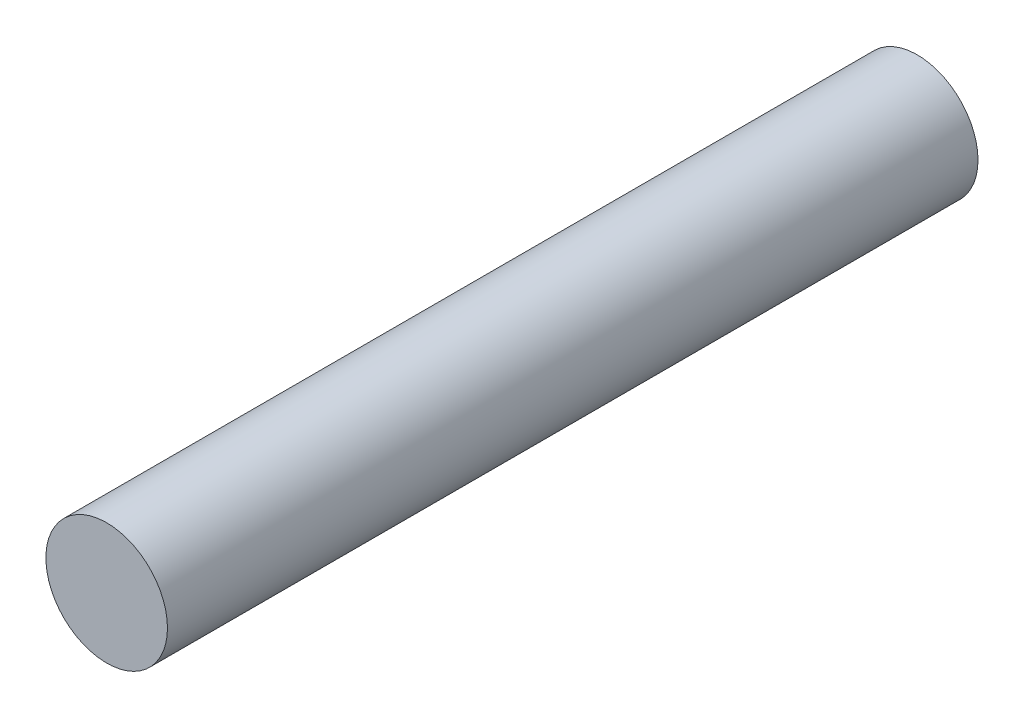
ISO-10303-21;
HEADER;
FILE_DESCRIPTION(('STEP AP214'),'2;1');
FILE_NAME('part.step','',(''),(''),'','','');
FILE_SCHEMA(('AUTOMOTIVE_DESIGN { 1 0 10303 214 1 1 1 1 }'));
ENDSEC;
DATA;
#1=APPLICATION_CONTEXT('core data for automotive mechanical design processes');
#2=APPLICATION_PROTOCOL_DEFINITION('international standard','automotive_design',2000,#1);
#3=PRODUCT_CONTEXT('',#1,'mechanical');
#4=PRODUCT('Part','Part','',(#3));
#5=PRODUCT_RELATED_PRODUCT_CATEGORY('part','',(#4));
#6=PRODUCT_DEFINITION_FORMATION('','',#4);
#7=PRODUCT_DEFINITION_CONTEXT('part definition',#1,'design');
#8=PRODUCT_DEFINITION('design','',#6,#7);
#9=PRODUCT_DEFINITION_SHAPE('','',#8);
#10=(LENGTH_UNIT() NAMED_UNIT(*) SI_UNIT(.MILLI.,.METRE.));
#11=(NAMED_UNIT(*) PLANE_ANGLE_UNIT() SI_UNIT($,.RADIAN.));
#12=(NAMED_UNIT(*) SI_UNIT($,.STERADIAN.) SOLID_ANGLE_UNIT());
#13=UNCERTAINTY_MEASURE_WITH_UNIT(LENGTH_MEASURE(1.E-05),#10,'distance_accuracy_value','');
#14=(GEOMETRIC_REPRESENTATION_CONTEXT(3) GLOBAL_UNCERTAINTY_ASSIGNED_CONTEXT((#13)) GLOBAL_UNIT_ASSIGNED_CONTEXT((#10,
#11,#12)) REPRESENTATION_CONTEXT('',''));
#15=CARTESIAN_POINT('',(0.,0.,0.));
#16=DIRECTION('',(0.,0.,1.));
#17=DIRECTION('',(1.,0.,0.));
#18=AXIS2_PLACEMENT_3D('',#15,#16,#17);
#19=CARTESIAN_POINT('',(0.,0.,50.));
#20=DIRECTION('',(0.,0.,-1.));
#21=DIRECTION('',(-1.,0.,0.));
#22=AXIS2_PLACEMENT_3D('',#19,#20,#21);
#23=CYLINDRICAL_SURFACE('',#22,7.5);
#24=CARTESIAN_POINT('',(0.,0.,50.));
#25=DIRECTION('',(0.,0.,1.));
#26=DIRECTION('',(1.,0.,0.));
#27=AXIS2_PLACEMENT_3D('',#24,#25,#26);
#28=CIRCLE('',#27,7.5);
#29=CARTESIAN_POINT('',(7.5,0.,50.));
#30=VERTEX_POINT('',#29);
#31=EDGE_CURVE('E10',#30,#30,#28,.T.);
#32=ORIENTED_EDGE('',*,*,#31,.F.);
#33=EDGE_LOOP('',(#32));
#34=FACE_BOUND('',#33,.T.);
#35=CARTESIAN_POINT('',(0.,0.,-50.));
#36=DIRECTION('',(0.,0.,1.));
#37=DIRECTION('',(1.,0.,0.));
#38=AXIS2_PLACEMENT_3D('',#35,#36,#37);
#39=CIRCLE('',#38,7.5);
#40=CARTESIAN_POINT('',(7.5,0.,-50.));
#41=VERTEX_POINT('',#40);
#42=EDGE_CURVE('E40',#41,#41,#39,.T.);
#43=ORIENTED_EDGE('',*,*,#42,.T.);
#44=EDGE_LOOP('',(#43));
#45=FACE_BOUND('',#44,.T.);
#46=ADVANCED_FACE('F37',(#34,#45),#23,.T.);
#47=CARTESIAN_POINT('',(0.,0.,50.));
#48=DIRECTION('',(0.,0.,1.));
#49=DIRECTION('',(1.,0.,0.));
#50=AXIS2_PLACEMENT_3D('',#47,#48,#49);
#51=PLANE('',#50);
#52=ORIENTED_EDGE('',*,*,#31,.T.);
#53=EDGE_LOOP('',(#52));
#54=FACE_BOUND('',#53,.T.);
#55=ADVANCED_FACE('F52',(#54),#51,.T.);
#56=CARTESIAN_POINT('',(0.,0.,-50.));
#57=DIRECTION('',(0.,0.,1.));
#58=DIRECTION('',(1.,0.,0.));
#59=AXIS2_PLACEMENT_3D('',#56,#57,#58);
#60=PLANE('',#59);
#61=ORIENTED_EDGE('',*,*,#42,.F.);
#62=EDGE_LOOP('',(#61));
#63=FACE_BOUND('',#62,.T.);
#64=ADVANCED_FACE('F50',(#63),#60,.F.);
#65=CLOSED_SHELL('',(#46,#55,#64));
#66=MANIFOLD_SOLID_BREP('B2',#65);
#67=ADVANCED_BREP_SHAPE_REPRESENTATION('',(#18,#66),#14);
#68=SHAPE_DEFINITION_REPRESENTATION(#9,#67);
ENDSEC;
END-ISO-10303-21;
